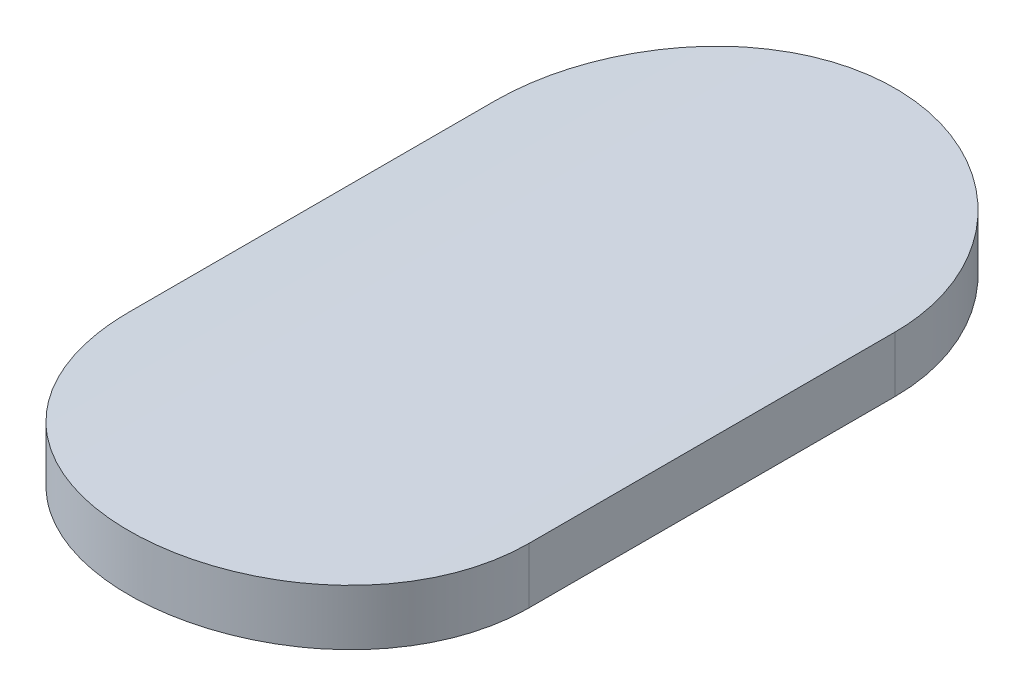
ISO-10303-21;
HEADER;
FILE_DESCRIPTION(('STEP AP214'),'2;1');
FILE_NAME('part.step','',(''),(''),'','','');
FILE_SCHEMA(('AUTOMOTIVE_DESIGN { 1 0 10303 214 1 1 1 1 }'));
ENDSEC;
DATA;
#1=APPLICATION_CONTEXT('core data for automotive mechanical design processes');
#2=APPLICATION_PROTOCOL_DEFINITION('international standard','automotive_design',2000,#1);
#3=PRODUCT_CONTEXT('',#1,'mechanical');
#4=PRODUCT('Part','Part','',(#3));
#5=PRODUCT_RELATED_PRODUCT_CATEGORY('part','',(#4));
#6=PRODUCT_DEFINITION_FORMATION('','',#4);
#7=PRODUCT_DEFINITION_CONTEXT('part definition',#1,'design');
#8=PRODUCT_DEFINITION('design','',#6,#7);
#9=PRODUCT_DEFINITION_SHAPE('','',#8);
#10=(LENGTH_UNIT() NAMED_UNIT(*) SI_UNIT(.MILLI.,.METRE.));
#11=(NAMED_UNIT(*) PLANE_ANGLE_UNIT() SI_UNIT($,.RADIAN.));
#12=(NAMED_UNIT(*) SI_UNIT($,.STERADIAN.) SOLID_ANGLE_UNIT());
#13=UNCERTAINTY_MEASURE_WITH_UNIT(LENGTH_MEASURE(1.E-05),#10,'distance_accuracy_value','');
#14=(GEOMETRIC_REPRESENTATION_CONTEXT(3) GLOBAL_UNCERTAINTY_ASSIGNED_CONTEXT((#13)) GLOBAL_UNIT_ASSIGNED_CONTEXT((#10,
#11,#12)) REPRESENTATION_CONTEXT('',''));
#15=CARTESIAN_POINT('',(0.,0.,0.));
#16=DIRECTION('',(0.,0.,1.));
#17=DIRECTION('',(1.,0.,0.));
#18=AXIS2_PLACEMENT_3D('',#15,#16,#17);
#19=CARTESIAN_POINT('',(-127.923352159799,-34.2539777719783,0.898559059800277));
#20=DIRECTION('',(0.,0.,1.));
#21=DIRECTION('',(1.,0.,0.));
#22=AXIS2_PLACEMENT_3D('',#19,#20,#21);
#23=CYLINDRICAL_SURFACE('',#22,4.);
#24=DIRECTION('',(0.,0.,1.));
#25=VECTOR('',#24,1.);
#26=CARTESIAN_POINT('',(-127.491108186985,-30.2774007077224,3.32767141799323));
#27=LINE('',#26,#25);
#28=CARTESIAN_POINT('',(-127.491108186985,-30.2774007077224,3.32767141799323));
#29=VERTEX_POINT('',#28);
#30=CARTESIAN_POINT('',(-127.491108186985,-30.2774007077224,2.53698122467281));
#31=VERTEX_POINT('',#30);
#32=EDGE_CURVE('E72',#29,#31,#27,.F.);
#33=ORIENTED_EDGE('',*,*,#32,.T.);
#34=CARTESIAN_POINT('',(-128.355596132613,-30.2774007077224,2.53698122467281));
#35=CARTESIAN_POINT('',(-128.355617122564,-30.2774093031019,2.51273949710901));
#36=CARTESIAN_POINT('',(-128.353558088976,-30.2771792736355,2.48850554374864));
#37=CARTESIAN_POINT('',(-128.34543664358,-30.2763057646066,2.44074868103929));
#38=CARTESIAN_POINT('',(-128.339378115823,-30.275662686187,2.41722510497195));
#39=CARTESIAN_POINT('',(-128.323410759997,-30.2740263383597,2.37152618341241));
#40=CARTESIAN_POINT('',(-128.313500468394,-30.2730329358545,2.34935135410467));
#41=CARTESIAN_POINT('',(-128.290122387864,-30.2708109602009,2.30698238800604));
#42=CARTESIAN_POINT('',(-128.276655134346,-30.2695824224536,2.28678795374451));
#43=CARTESIAN_POINT('',(-128.246485774422,-30.2670223239816,2.24886886010776));
#44=CARTESIAN_POINT('',(-128.229772278111,-30.2656904107286,2.23115328612991));
#45=CARTESIAN_POINT('',(-128.193602531438,-30.2630765062061,2.19876680889324));
#46=CARTESIAN_POINT('',(-128.174145251963,-30.2617945338994,2.184097053159));
#47=CARTESIAN_POINT('',(-128.132979806713,-30.2594212030673,2.1581877641263));
#48=CARTESIAN_POINT('',(-128.111265352569,-30.2583304011072,2.14695817765881));
#49=CARTESIAN_POINT('',(-128.06626175851,-30.256468301793,2.12832054764096));
#50=CARTESIAN_POINT('',(-128.042974493225,-30.2556966316195,2.12090804236421));
#51=CARTESIAN_POINT('',(-128.003525585014,-30.2547502618519,2.11193130537093));
#52=CARTESIAN_POINT('',(-127.98761455235,-30.2544619567996,2.10923732383193));
#53=CARTESIAN_POINT('',(-127.955588715831,-30.2540756112707,2.10563993703816));
#54=CARTESIAN_POINT('',(-127.939473908818,-30.2539775737453,2.10473655955752));
#55=CARTESIAN_POINT('',(-127.899148198746,-30.2539780695901,2.10473829122731));
#56=CARTESIAN_POINT('',(-127.874928590604,-30.2541997878823,2.10677707886363));
#57=CARTESIAN_POINT('',(-127.827162093491,-30.2550629316294,2.11487890770138));
#58=CARTESIAN_POINT('',(-127.803615946452,-30.2557048026716,2.12094622140061));
#59=CARTESIAN_POINT('',(-127.75789437027,-30.2573358336208,2.13692567576621));
#60=CARTESIAN_POINT('',(-127.735718096663,-30.2583247770098,2.14683541976898));
#61=CARTESIAN_POINT('',(-127.693347746542,-30.260539573146,2.17021388320407));
#62=CARTESIAN_POINT('',(-127.6731533329,-30.2617653854946,2.18368199589103));
#63=CARTESIAN_POINT('',(-127.635232215171,-30.264322400245,2.2138543183604));
#64=CARTESIAN_POINT('',(-127.617514873633,-30.2656539741725,2.23057026405761));
#65=CARTESIAN_POINT('',(-127.585130542844,-30.2682694573901,2.26674017806152));
#66=CARTESIAN_POINT('',(-127.570463816169,-30.2695533625694,2.28619438181726));
#67=CARTESIAN_POINT('',(-127.544561149847,-30.2719321143963,2.32735006486328));
#68=CARTESIAN_POINT('',(-127.533334696151,-30.2730264347539,2.34905754068577));
#69=CARTESIAN_POINT('',(-127.514694899956,-30.2748965279095,2.39406039077541));
#70=CARTESIAN_POINT('',(-127.507279455028,-30.275672476297,2.41735488147896));
#71=CARTESIAN_POINT('',(-127.498299357738,-30.2766239966666,2.45682173519688));
#72=CARTESIAN_POINT('',(-127.495604627655,-30.2769138194438,2.47274340164553));
#73=CARTESIAN_POINT('',(-127.492009108139,-30.2773027678914,2.50476814628887));
#74=CARTESIAN_POINT('',(-127.491105867911,-30.2774021540766,2.52087094629861));
#75=CARTESIAN_POINT('',(-127.491108186985,-30.2774007077224,2.53698122467281));
#76=B_SPLINE_CURVE_WITH_KNOTS('',3,(#34,#35,#36,#37,#38,#39,#40,#41,#42,#43,#44,#45,#46,#47,#48,
#49,#50,#51,#52,#53,#54,#55,#56,#57,#58,#59,#60,#61,#62,#63,#64,#65,#66,#67,#68,#69,#70,#71,#72,
#73,#74,#75),.UNSPECIFIED.,.F.,.F.,(4,2,2,2,2,2,2,2,2,2,2,2,2,2,2,2,2,2,2,2,4),(0.,
0.0726253836740616,0.145180341790964,0.217762895225312,0.290334529446831,0.363165547703872,
0.436023955754679,0.509091078909629,0.58207260007002,0.630397888655176,0.678723926810382,
0.751276944723526,0.823907032711242,0.89649189135627,0.969064381374195,1.04190415719804,
1.11475019997867,1.18779533226152,1.26080012417625,1.30915708875173,1.3574478542525),.UNSPECIFIED.);
#77=CARTESIAN_POINT('',(-128.355596132613,-30.2774007077224,2.53698122467281));
#78=VERTEX_POINT('',#77);
#79=EDGE_CURVE('E21',#78,#31,#76,.T.);
#80=ORIENTED_EDGE('',*,*,#79,.F.);
#81=DIRECTION('',(0.,0.,1.));
#82=VECTOR('',#81,1.);
#83=CARTESIAN_POINT('',(-128.355596132613,-30.2774007077224,2.53698122467281));
#84=LINE('',#83,#82);
#85=CARTESIAN_POINT('',(-128.355596132613,-30.2774007077224,3.32767141799323));
#86=VERTEX_POINT('',#85);
#87=EDGE_CURVE('E59',#78,#86,#84,.T.);
#88=ORIENTED_EDGE('',*,*,#87,.T.);
#89=CARTESIAN_POINT('',(-127.491108186985,-30.2774007077224,3.32767141799323));
#90=CARTESIAN_POINT('',(-127.491087200258,-30.2774093032284,3.35191322019586));
#91=CARTESIAN_POINT('',(-127.493146244914,-30.2771792722828,3.37614724800922));
#92=CARTESIAN_POINT('',(-127.501267711605,-30.2763057606253,3.4239041065303));
#93=CARTESIAN_POINT('',(-127.507326225035,-30.2756626835922,3.4474276081738));
#94=CARTESIAN_POINT('',(-127.523293392494,-30.2740263559012,3.49312597135359));
#95=CARTESIAN_POINT('',(-127.533203439736,-30.2730329785416,3.51530034150925));
#96=CARTESIAN_POINT('',(-127.556581342248,-30.2708110127296,3.55766938751539));
#97=CARTESIAN_POINT('',(-127.570048813953,-30.269582449639,3.57786427647313));
#98=CARTESIAN_POINT('',(-127.600220287064,-30.2670221805072,3.61578591746699));
#99=CARTESIAN_POINT('',(-127.6169359698,-30.2656901129391,3.63350335222846));
#100=CARTESIAN_POINT('',(-127.653105985133,-30.2630762167541,3.66588911330931));
#101=CARTESIAN_POINT('',(-127.672560734073,-30.2617943958127,3.68055697524709));
#102=CARTESIAN_POINT('',(-127.713713980875,-30.2594218523872,3.7064579120408));
#103=CARTESIAN_POINT('',(-127.735417823731,-30.2583316025356,3.71768254141423));
#104=CARTESIAN_POINT('',(-127.780414746846,-30.256469127083,3.73632373673414));
#105=CARTESIAN_POINT('',(-127.803707686985,-30.2556968734842,3.74374063794229));
#106=CARTESIAN_POINT('',(-127.851126252775,-30.2545598909362,3.75452875151395));
#107=CARTESIAN_POINT('',(-127.875248269521,-30.2541935815582,3.75791565734687));
#108=CARTESIAN_POINT('',(-127.923721524934,-30.2539043752213,3.76059623696211));
#109=CARTESIAN_POINT('',(-127.948072762323,-30.2539814757901,3.75988993356703));
#110=CARTESIAN_POINT('',(-127.996205292226,-30.2545691293883,3.75441668768759));
#111=CARTESIAN_POINT('',(-128.019988542231,-30.2550778685343,3.74966673762007));
#112=CARTESIAN_POINT('',(-128.066418176187,-30.2564695592699,3.73626755518268));
#113=CARTESIAN_POINT('',(-128.089064549109,-30.2573525144896,3.72761828498679));
#114=CARTESIAN_POINT('',(-128.132631413093,-30.2593965328097,3.70664731910565));
#115=CARTESIAN_POINT('',(-128.153548245803,-30.2605581661113,3.69431808106821));
#116=CARTESIAN_POINT('',(-128.193021297876,-30.2630292276311,3.66634324034917));
#117=CARTESIAN_POINT('',(-128.211577539937,-30.2643386544279,3.65069766955997));
#118=CARTESIAN_POINT('',(-128.245901026669,-30.266966287132,3.61644108169202));
#119=CARTESIAN_POINT('',(-128.261653919007,-30.2682845042809,3.59781568194459));
#120=CARTESIAN_POINT('',(-128.289816419944,-30.2707749518531,3.55817100557871));
#121=CARTESIAN_POINT('',(-128.302225018855,-30.2719471381305,3.53715100871693));
#122=CARTESIAN_POINT('',(-128.323347957904,-30.2740134538803,3.49329584496552));
#123=CARTESIAN_POINT('',(-128.33205911907,-30.2749073439048,3.47045913605631));
#124=CARTESIAN_POINT('',(-128.345502485206,-30.276310415507,3.42366306664783));
#125=CARTESIAN_POINT('',(-128.350240700685,-30.276820178097,3.39970546010047));
#126=CARTESIAN_POINT('',(-128.354711987777,-30.2773050457114,3.35963719078505));
#127=CARTESIAN_POINT('',(-128.355603730248,-30.2774034970038,3.34365045375634));
#128=CARTESIAN_POINT('',(-128.355596132613,-30.2774007077224,3.32767141799323));
#129=B_SPLINE_CURVE_WITH_KNOTS('',3,(#89,#90,#91,#92,#93,#94,#95,#96,#97,#98,#99,#100,#101,#102,
#103,#104,#105,#106,#107,#108,#109,#110,#111,#112,#113,#114,#115,#116,#117,#118,#119,#120,#121,
#122,#123,#124,#125,#126,#127,#128),.UNSPECIFIED.,.F.,.F.,(4,2,2,2,2,2,2,2,2,2,2,2,2,2,2,2,2,2,
2,4),(0.,0.0726256062913224,0.145180341787483,0.217761346895158,0.290334529464339,
0.363173700807065,0.436023955812664,0.509051493289564,0.582072599757541,0.654808409475985,
0.72754381364014,0.799975065682706,0.872407020372288,0.944988460927709,1.01756920351632,
1.09051146956909,1.1634757333035,1.23650260356939,1.30941879404999,1.35735159725356),.UNSPECIFIED.);
#130=EDGE_CURVE('E73',#29,#86,#129,.T.);
#131=ORIENTED_EDGE('',*,*,#130,.F.);
#132=EDGE_LOOP('',(#33,#80,#88,#131));
#133=FACE_BOUND('',#132,.T.);
#134=ADVANCED_FACE('F17',(#133),#23,.T.);
#135=CARTESIAN_POINT('',(-127.491108186985,-36.1825523620957,3.32767141799323));
#136=DIRECTION('',(-1.,0.,0.));
#137=DIRECTION('',(0.,0.,1.));
#138=AXIS2_PLACEMENT_3D('',#135,#136,#137);
#139=PLANE('',#138);
#140=DIRECTION('',(0.,0.,1.));
#141=VECTOR('',#140,1.);
#142=CARTESIAN_POINT('',(-127.491108186985,-30.3981295970671,0.898559059800277));
#143=LINE('',#142,#141);
#144=CARTESIAN_POINT('',(-127.491108186985,-30.3981295970671,3.32767141799323));
#145=VERTEX_POINT('',#144);
#146=CARTESIAN_POINT('',(-127.491108186985,-30.3981295970671,2.53698122467281));
#147=VERTEX_POINT('',#146);
#148=EDGE_CURVE('E80',#145,#147,#143,.F.);
#149=ORIENTED_EDGE('',*,*,#148,.T.);
#150=DIRECTION('',(0.,-1.,0.));
#151=VECTOR('',#150,1.);
#152=CARTESIAN_POINT('',(-127.491108186985,-36.1825523620957,2.53698122467281));
#153=LINE('',#152,#151);
#154=EDGE_CURVE('E67',#31,#147,#153,.T.);
#155=ORIENTED_EDGE('',*,*,#154,.F.);
#156=ORIENTED_EDGE('',*,*,#32,.F.);
#157=DIRECTION('',(0.,-1.,0.));
#158=VECTOR('',#157,1.);
#159=CARTESIAN_POINT('',(-127.491108186985,-36.1825523620957,3.32767141799323));
#160=LINE('',#159,#158);
#161=EDGE_CURVE('E106',#145,#29,#160,.F.);
#162=ORIENTED_EDGE('',*,*,#161,.F.);
#163=EDGE_LOOP('',(#149,#155,#156,#162));
#164=FACE_BOUND('',#163,.T.);
#165=ADVANCED_FACE('F79',(#164),#139,.F.);
#166=CARTESIAN_POINT('',(-127.923352159799,-36.1825523620957,2.53698122467281));
#167=DIRECTION('',(0.,-1.,0.));
#168=DIRECTION('',(0.,0.,-1.));
#169=AXIS2_PLACEMENT_3D('',#166,#167,#168);
#170=CYLINDRICAL_SURFACE('',#169,0.432243972813884);
#171=CARTESIAN_POINT('',(-127.491108186985,-30.3981295970671,2.53698122467281));
#172=CARTESIAN_POINT('',(-127.491087176005,-30.3981384613911,2.51274420708842));
#173=CARTESIAN_POINT('',(-127.493145434531,-30.3979013183327,2.48851506523686));
#174=CARTESIAN_POINT('',(-127.50126353888,-30.3970008343414,2.44076821724568));
#175=CARTESIAN_POINT('',(-127.507319440707,-30.3963379134897,2.4172498337776));
#176=CARTESIAN_POINT('',(-127.523279427615,-30.3946511351842,2.37156124941147));
#177=CARTESIAN_POINT('',(-127.533184950578,-30.3936271428788,2.34939155584868));
#178=CARTESIAN_POINT('',(-127.556551387832,-30.3913367859818,2.30703181305382));
#179=CARTESIAN_POINT('',(-127.570011787124,-30.390070456505,2.2868414776506));
#180=CARTESIAN_POINT('',(-127.600169143537,-30.3874312779715,2.24892442616001));
#181=CARTESIAN_POINT('',(-127.616878216478,-30.3860580420779,2.23120737278264));
#182=CARTESIAN_POINT('',(-127.653039344167,-30.3833629484715,2.19881684750771));
#183=CARTESIAN_POINT('',(-127.672492427153,-30.3820411102565,2.1841445216477));
#184=CARTESIAN_POINT('',(-127.713653639597,-30.3795936233061,2.15822684617402));
#185=CARTESIAN_POINT('',(-127.735368406291,-30.3784685795403,2.14699198710735));
#186=CARTESIAN_POINT('',(-127.780374427183,-30.3765478765735,2.12834420100711));
#187=CARTESIAN_POINT('',(-127.803663803901,-30.3757518328769,2.12092681007651));
#188=CARTESIAN_POINT('',(-127.843125385669,-30.3747752200699,2.11194096821672));
#189=CARTESIAN_POINT('',(-127.859046755777,-30.3744776019595,2.10924337989965));
#190=CARTESIAN_POINT('',(-127.891093821193,-30.3740787743024,2.10564116160223));
#191=CARTESIAN_POINT('',(-127.907219519592,-30.3739775677314,2.10473655878582));
#192=CARTESIAN_POINT('',(-127.947551264425,-30.3739780783505,2.10473829147479));
#193=CARTESIAN_POINT('',(-127.971765988302,-30.3742065617847,2.10677627113737));
#194=CARTESIAN_POINT('',(-128.019522627822,-30.3750960459599,2.11487473790828));
#195=CARTESIAN_POINT('',(-128.043063802579,-30.3757575052113,2.12093948936334));
#196=CARTESIAN_POINT('',(-128.088775364138,-30.3774383313766,2.13691173741433));
#197=CARTESIAN_POINT('',(-128.110946610709,-30.37845747107,2.14681679483116));
#198=CARTESIAN_POINT('',(-128.153307852799,-30.3807399867703,2.17018377605912));
#199=CARTESIAN_POINT('',(-128.17349818065,-30.3820033217033,2.18364510184107));
#200=CARTESIAN_POINT('',(-128.211417161898,-30.3846390968794,2.2138054763765));
#201=CARTESIAN_POINT('',(-128.2291358879,-30.386011944167,2.23051697114461));
#202=CARTESIAN_POINT('',(-128.261524100921,-30.3887087594235,2.26667819046394));
#203=CARTESIAN_POINT('',(-128.27619332337,-30.3900327231431,2.28612815235363));
#204=CARTESIAN_POINT('',(-128.302104305741,-30.3924861836675,2.32727958395471));
#205=CARTESIAN_POINT('',(-128.313336019618,-30.39361510636,2.34898740913519));
#206=CARTESIAN_POINT('',(-128.331985926315,-30.3955445537706,2.39399272063595));
#207=CARTESIAN_POINT('',(-128.339406230906,-30.3963452602922,2.41728931854871));
#208=CARTESIAN_POINT('',(-128.348395355563,-30.3973275070232,2.45676871319683));
#209=CARTESIAN_POINT('',(-128.351093656768,-30.3976267939651,2.47270058191502));
#210=CARTESIAN_POINT('',(-128.354693994571,-30.3980284543278,2.50474639365463));
#211=CARTESIAN_POINT('',(-128.355598470814,-30.3981310951857,2.52086005937118));
#212=CARTESIAN_POINT('',(-128.355596132613,-30.3981295970671,2.53698122467281));
#213=B_SPLINE_CURVE_WITH_KNOTS('',3,(#171,#172,#173,#174,#175,#176,#177,#178,#179,#180,#181,
#182,#183,#184,#185,#186,#187,#188,#189,#190,#191,#192,#193,#194,#195,#196,#197,#198,#199,#200,
#201,#202,#203,#204,#205,#206,#207,#208,#209,#210,#211,#212),.UNSPECIFIED.,.F.,.F.,(4,2,2,2,2,2,
2,2,2,2,2,2,2,2,2,2,2,2,2,2,4),(0.,0.0726110703568821,0.14515061093212,0.217717272017475,
0.290273426057522,0.363105554309546,0.435965047098417,0.509044726041053,0.582038755124304,
0.630396664646984,0.678755306791643,0.751293702605126,0.82390903928089,0.89647832951794,
0.969035424117947,1.04187603897329,1.1147229706965,1.18778080670378,1.26079812010336,
1.30918729504396,1.35751061429023),.UNSPECIFIED.);
#214=CARTESIAN_POINT('',(-128.355596132613,-30.3981295970671,2.53698122467281));
#215=VERTEX_POINT('',#214);
#216=EDGE_CURVE('E91',#147,#215,#213,.T.);
#217=ORIENTED_EDGE('',*,*,#216,.T.);
#218=DIRECTION('',(0.,1.,0.));
#219=VECTOR('',#218,1.);
#220=CARTESIAN_POINT('',(-128.355596132613,-36.1825523620957,2.53698122467281));
#221=LINE('',#220,#219);
#222=EDGE_CURVE('E69',#215,#78,#221,.T.);
#223=ORIENTED_EDGE('',*,*,#222,.T.);
#224=ORIENTED_EDGE('',*,*,#79,.T.);
#225=ORIENTED_EDGE('',*,*,#154,.T.);
#226=EDGE_LOOP('',(#217,#223,#224,#225));
#227=FACE_BOUND('',#226,.T.);
#228=ADVANCED_FACE('F65',(#227),#170,.T.);
#229=CARTESIAN_POINT('',(-128.355596132613,-36.1825523620957,2.53698122467281));
#230=DIRECTION('',(1.,0.,0.));
#231=DIRECTION('',(0.,1.,0.));
#232=AXIS2_PLACEMENT_3D('',#229,#230,#231);
#233=PLANE('',#232);
#234=DIRECTION('',(0.,0.,1.));
#235=VECTOR('',#234,1.);
#236=CARTESIAN_POINT('',(-128.355596132613,-30.3981295970671,0.898559059800277));
#237=LINE('',#236,#235);
#238=CARTESIAN_POINT('',(-128.355596132613,-30.3981295970671,3.32767141799323));
#239=VERTEX_POINT('',#238);
#240=EDGE_CURVE('E31',#215,#239,#237,.T.);
#241=ORIENTED_EDGE('',*,*,#240,.T.);
#242=DIRECTION('',(0.,-1.,0.));
#243=VECTOR('',#242,1.);
#244=CARTESIAN_POINT('',(-128.355596132613,-36.1825523620957,3.32767141799323));
#245=LINE('',#244,#243);
#246=EDGE_CURVE('E39',#86,#239,#245,.T.);
#247=ORIENTED_EDGE('',*,*,#246,.F.);
#248=ORIENTED_EDGE('',*,*,#87,.F.);
#249=ORIENTED_EDGE('',*,*,#222,.F.);
#250=EDGE_LOOP('',(#241,#247,#248,#249));
#251=FACE_BOUND('',#250,.T.);
#252=ADVANCED_FACE('F101',(#251),#233,.F.);
#253=CARTESIAN_POINT('',(-127.923352159799,-36.1825523620957,3.32767141799323));
#254=DIRECTION('',(0.,-1.,0.));
#255=DIRECTION('',(0.,0.,-1.));
#256=AXIS2_PLACEMENT_3D('',#253,#254,#255);
#257=CYLINDRICAL_SURFACE('',#256,0.43224397281389);
#258=ORIENTED_EDGE('',*,*,#246,.T.);
#259=CARTESIAN_POINT('',(-128.355596132613,-30.3981295970671,3.32767141799323));
#260=CARTESIAN_POINT('',(-128.355617140371,-30.3981384615207,3.35190850934034));
#261=CARTESIAN_POINT('',(-128.353558870927,-30.3979013169546,3.37613772477169));
#262=CARTESIAN_POINT('',(-128.345440745574,-30.3970008302842,3.42388456862371));
#263=CARTESIAN_POINT('',(-128.339384857923,-30.3963379108451,3.4474028785418));
#264=CARTESIAN_POINT('',(-128.323425058573,-30.3946511532194,3.49309090672824));
#265=CARTESIAN_POINT('',(-128.313519779202,-30.3936271867664,3.51526014243438));
#266=CARTESIAN_POINT('',(-128.290153519454,-30.3913368399867,3.55761996488444));
#267=CARTESIAN_POINT('',(-128.276692902714,-30.390070484455,3.57781075369327));
#268=CARTESIAN_POINT('',(-128.24653343749,-30.3874311302913,3.61573034802934));
#269=CARTESIAN_POINT('',(-128.229822182128,-30.3860577355525,3.63344925934196));
#270=CARTESIAN_POINT('',(-128.193660786458,-30.3833626505135,3.665839069848));
#271=CARTESIAN_POINT('',(-128.174210229727,-30.3820409681134,3.6805095047771));
#272=CARTESIAN_POINT('',(-128.133061201093,-30.379594292289,3.70641883407464));
#273=CARTESIAN_POINT('',(-128.111357034986,-30.3784698173995,3.71764873812837));
#274=CARTESIAN_POINT('',(-128.066357682618,-30.3765487271556,3.73630008616412));
#275=CARTESIAN_POINT('',(-128.043062639067,-30.3757520824379,3.7437218712487));
#276=CARTESIAN_POINT('',(-127.995644198458,-30.3745791444223,3.75451743019877));
#277=CARTESIAN_POINT('',(-127.971524641818,-30.3742011197578,3.75790788154323));
#278=CARTESIAN_POINT('',(-127.923055516728,-30.3739021121989,3.76059618630038));
#279=CARTESIAN_POINT('',(-127.898705949971,-30.373981125943,3.75989406981321));
#280=CARTESIAN_POINT('',(-127.850582638488,-30.3745858992713,3.75443048586941));
#281=CARTESIAN_POINT('',(-127.826806815965,-30.3751096722969,3.74968706894106));
#282=CARTESIAN_POINT('',(-127.780390950882,-30.3765428469413,3.73630371854212));
#283=CARTESIAN_POINT('',(-127.757750920178,-30.377452252585,3.72766374440161));
#284=CARTESIAN_POINT('',(-127.71419228989,-30.3795579222314,3.70671280188923));
#285=CARTESIAN_POINT('',(-127.693277561843,-30.3807548090076,3.69439384940977));
#286=CARTESIAN_POINT('',(-127.653806526194,-30.3833012247143,3.66644103639038));
#287=CARTESIAN_POINT('',(-127.635250201735,-30.3846507525537,3.65080719954726));
#288=CARTESIAN_POINT('',(-127.600918114686,-30.3873597422384,3.6165693066567));
#289=CARTESIAN_POINT('',(-127.585157616252,-30.3887192188171,3.59794994201546));
#290=CARTESIAN_POINT('',(-127.55697882666,-30.3912880781798,3.55831555791992));
#291=CARTESIAN_POINT('',(-127.544561541805,-30.3924974157133,3.53729981986417));
#292=CARTESIAN_POINT('',(-127.523420239153,-30.3946297265931,3.49345028437393));
#293=CARTESIAN_POINT('',(-127.514699494701,-30.3955524459422,3.47061489677675));
#294=CARTESIAN_POINT('',(-127.501237187884,-30.3970012852222,3.42381902389741));
#295=CARTESIAN_POINT('',(-127.496489618272,-30.3975280037641,3.39986029518926));
#296=CARTESIAN_POINT('',(-127.491998016267,-30.3980303038749,3.35973967711018));
#297=CARTESIAN_POINT('',(-127.491100513304,-30.3981325015031,3.34370171057308));
#298=CARTESIAN_POINT('',(-127.491108186985,-30.3981295970671,3.32767141799323));
#299=B_SPLINE_CURVE_WITH_KNOTS('',3,(#259,#260,#261,#262,#263,#264,#265,#266,#267,#268,#269,
#270,#271,#272,#273,#274,#275,#276,#277,#278,#279,#280,#281,#282,#283,#284,#285,#286,#287,#288,
#289,#290,#291,#292,#293,#294,#295,#296,#297,#298),.UNSPECIFIED.,.F.,.F.,(4,2,2,2,2,2,2,2,2,2,2,
2,2,2,2,2,2,2,2,4),(0.,0.0726112903627205,0.145150610928534,0.217715728023078,0.290273426076025,
0.363113694111983,0.435965047158868,0.509005172732491,0.582038754780198,0.654769136547268,
0.727498983395611,0.799905674146982,0.872313120653309,0.944878861818139,1.01744408425655,
1.09039404692341,1.16336594294014,1.23640232239222,1.30932807382706,1.35741434342201),.UNSPECIFIED.);
#300=EDGE_CURVE('E11',#239,#145,#299,.T.);
#301=ORIENTED_EDGE('',*,*,#300,.T.);
#302=ORIENTED_EDGE('',*,*,#161,.T.);
#303=ORIENTED_EDGE('',*,*,#130,.T.);
#304=EDGE_LOOP('',(#258,#301,#302,#303));
#305=FACE_BOUND('',#304,.T.);
#306=ADVANCED_FACE('F97',(#305),#257,.T.);
#307=CARTESIAN_POINT('',(-127.923352159799,-34.2539777719783,0.898559059800277));
#308=DIRECTION('',(0.,0.,1.));
#309=DIRECTION('',(1.,0.,0.));
#310=AXIS2_PLACEMENT_3D('',#307,#308,#309);
#311=CYLINDRICAL_SURFACE('',#310,3.87999999999999);
#312=ORIENTED_EDGE('',*,*,#240,.F.);
#313=ORIENTED_EDGE('',*,*,#216,.F.);
#314=ORIENTED_EDGE('',*,*,#148,.F.);
#315=ORIENTED_EDGE('',*,*,#300,.F.);
#316=EDGE_LOOP('',(#312,#313,#314,#315));
#317=FACE_BOUND('',#316,.T.);
#318=ADVANCED_FACE('F95',(#317),#311,.F.);
#319=CLOSED_SHELL('',(#134,#165,#228,#252,#306,#318));
#320=MANIFOLD_SOLID_BREP('B1',#319);
#321=ADVANCED_BREP_SHAPE_REPRESENTATION('',(#18,#320),#14);
#322=SHAPE_DEFINITION_REPRESENTATION(#9,#321);
ENDSEC;
END-ISO-10303-21;
